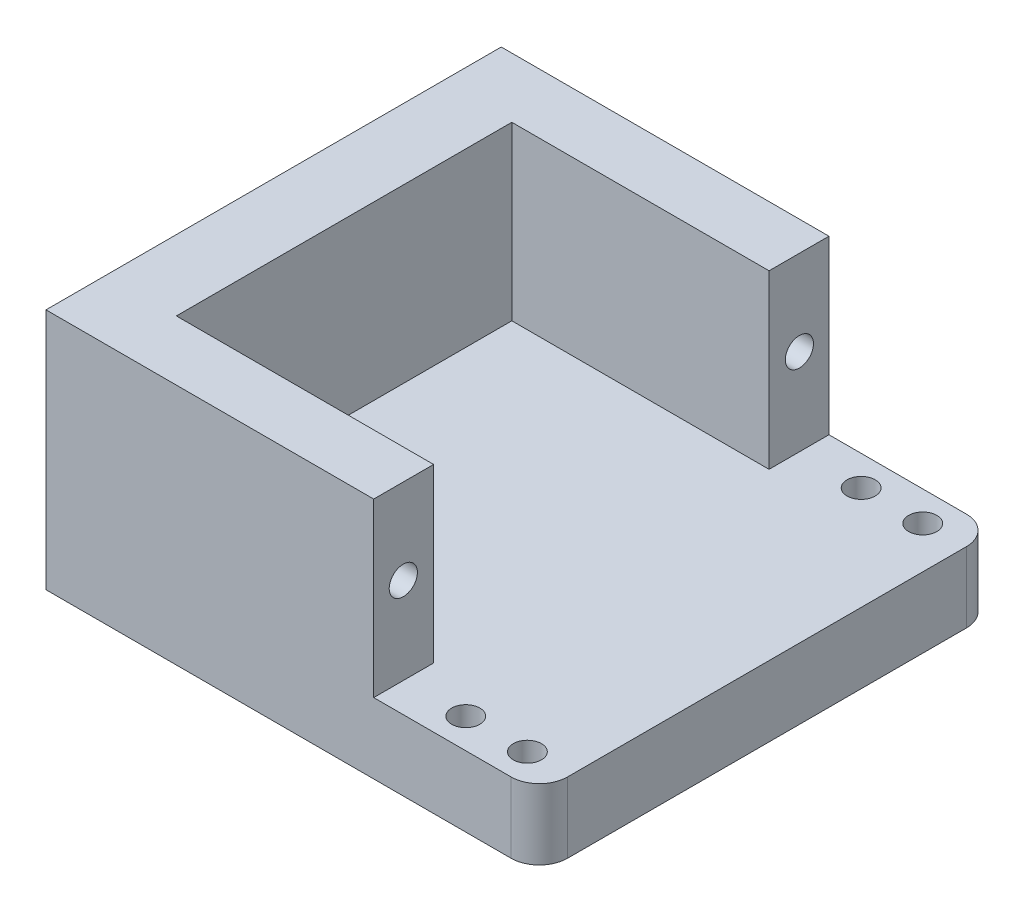
ISO-10303-21;
HEADER;
FILE_DESCRIPTION(('STEP AP214'),'2;1');
FILE_NAME('part.step','',(''),(''),'','','');
FILE_SCHEMA(('AUTOMOTIVE_DESIGN { 1 0 10303 214 1 1 1 1 }'));
ENDSEC;
DATA;
#1=APPLICATION_CONTEXT('core data for automotive mechanical design processes');
#2=APPLICATION_PROTOCOL_DEFINITION('international standard','automotive_design',2000,#1);
#3=PRODUCT_CONTEXT('',#1,'mechanical');
#4=PRODUCT('Part','Part','',(#3));
#5=PRODUCT_RELATED_PRODUCT_CATEGORY('part','',(#4));
#6=PRODUCT_DEFINITION_FORMATION('','',#4);
#7=PRODUCT_DEFINITION_CONTEXT('part definition',#1,'design');
#8=PRODUCT_DEFINITION('design','',#6,#7);
#9=PRODUCT_DEFINITION_SHAPE('','',#8);
#10=(LENGTH_UNIT() NAMED_UNIT(*) SI_UNIT(.MILLI.,.METRE.));
#11=(NAMED_UNIT(*) PLANE_ANGLE_UNIT() SI_UNIT($,.RADIAN.));
#12=(NAMED_UNIT(*) SI_UNIT($,.STERADIAN.) SOLID_ANGLE_UNIT());
#13=UNCERTAINTY_MEASURE_WITH_UNIT(LENGTH_MEASURE(1.E-05),#10,'distance_accuracy_value','');
#14=(GEOMETRIC_REPRESENTATION_CONTEXT(3) GLOBAL_UNCERTAINTY_ASSIGNED_CONTEXT((#13)) GLOBAL_UNIT_ASSIGNED_CONTEXT((#10,
#11,#12)) REPRESENTATION_CONTEXT('',''));
#15=CARTESIAN_POINT('',(0.,0.,0.));
#16=DIRECTION('',(0.,0.,1.));
#17=DIRECTION('',(1.,0.,0.));
#18=AXIS2_PLACEMENT_3D('',#15,#16,#17);
#19=CARTESIAN_POINT('',(0.,0.,0.));
#20=DIRECTION('',(0.,-1.,0.));
#21=DIRECTION('',(0.,0.,-1.));
#22=AXIS2_PLACEMENT_3D('',#19,#20,#21);
#23=PLANE('',#22);
#24=CARTESIAN_POINT('',(2.32234909325684,0.,-30.175));
#25=DIRECTION('',(0.,1.,0.));
#26=DIRECTION('',(0.,0.,1.));
#27=AXIS2_PLACEMENT_3D('',#24,#25,#26);
#28=CIRCLE('',#27,1.);
#29=CARTESIAN_POINT('',(2.32234909325684,0.,-29.175));
#30=VERTEX_POINT('',#29);
#31=EDGE_CURVE('E574',#30,#30,#28,.T.);
#32=ORIENTED_EDGE('',*,*,#31,.T.);
#33=EDGE_LOOP('',(#32));
#34=FACE_BOUND('',#33,.T.);
#35=CARTESIAN_POINT('',(32.0281080719325,0.,-30.175));
#36=DIRECTION('',(0.,1.,0.));
#37=DIRECTION('',(0.,0.,1.));
#38=AXIS2_PLACEMENT_3D('',#35,#36,#37);
#39=CIRCLE('',#38,0.999999999999998);
#40=CARTESIAN_POINT('',(32.0281080719325,0.,-29.175));
#41=VERTEX_POINT('',#40);
#42=EDGE_CURVE('E551',#41,#41,#39,.T.);
#43=ORIENTED_EDGE('',*,*,#42,.T.);
#44=EDGE_LOOP('',(#43));
#45=FACE_BOUND('',#44,.T.);
#46=CARTESIAN_POINT('',(32.0281080719325,0.,-2.125));
#47=DIRECTION('',(0.,1.,0.));
#48=DIRECTION('',(0.,0.,1.));
#49=AXIS2_PLACEMENT_3D('',#46,#47,#48);
#50=CIRCLE('',#49,0.999999999999998);
#51=CARTESIAN_POINT('',(32.0281080719325,0.,-1.125));
#52=VERTEX_POINT('',#51);
#53=EDGE_CURVE('E557',#52,#52,#50,.F.);
#54=ORIENTED_EDGE('',*,*,#53,.F.);
#55=EDGE_LOOP('',(#54));
#56=FACE_BOUND('',#55,.T.);
#57=CARTESIAN_POINT('',(27.6570821501849,0.,-30.175));
#58=DIRECTION('',(0.,1.,0.));
#59=DIRECTION('',(0.,0.,1.));
#60=AXIS2_PLACEMENT_3D('',#57,#58,#59);
#61=CIRCLE('',#60,1.);
#62=CARTESIAN_POINT('',(27.6570821501849,0.,-29.175));
#63=VERTEX_POINT('',#62);
#64=EDGE_CURVE('E543',#63,#63,#61,.T.);
#65=ORIENTED_EDGE('',*,*,#64,.T.);
#66=EDGE_LOOP('',(#65));
#67=FACE_BOUND('',#66,.T.);
#68=DIRECTION('',(-1.,0.,0.));
#69=VECTOR('',#68,1.);
#70=CARTESIAN_POINT('',(0.,0.,-32.3));
#71=LINE('',#70,#69);
#72=CARTESIAN_POINT('',(33.,0.,-32.3));
#73=VERTEX_POINT('',#72);
#74=CARTESIAN_POINT('',(0.,0.,-32.3));
#75=VERTEX_POINT('',#74);
#76=EDGE_CURVE('E200',#73,#75,#71,.T.);
#77=ORIENTED_EDGE('',*,*,#76,.F.);
#78=CARTESIAN_POINT('',(33.,0.,-30.3));
#79=DIRECTION('',(0.,-1.,0.));
#80=DIRECTION('',(0.,0.,-1.));
#81=AXIS2_PLACEMENT_3D('',#78,#79,#80);
#82=CIRCLE('',#81,2.);
#83=CARTESIAN_POINT('',(35.,0.,-30.3));
#84=VERTEX_POINT('',#83);
#85=EDGE_CURVE('E222',#73,#84,#82,.T.);
#86=ORIENTED_EDGE('',*,*,#85,.T.);
#87=DIRECTION('',(0.,0.,-1.));
#88=VECTOR('',#87,1.);
#89=CARTESIAN_POINT('',(35.,0.,0.));
#90=LINE('',#89,#88);
#91=CARTESIAN_POINT('',(35.,0.,-2.));
#92=VERTEX_POINT('',#91);
#93=EDGE_CURVE('E209',#92,#84,#90,.T.);
#94=ORIENTED_EDGE('',*,*,#93,.F.);
#95=CARTESIAN_POINT('',(33.,0.,-2.));
#96=DIRECTION('',(0.,-1.,0.));
#97=DIRECTION('',(0.,0.,-1.));
#98=AXIS2_PLACEMENT_3D('',#95,#96,#97);
#99=CIRCLE('',#98,2.);
#100=CARTESIAN_POINT('',(33.,0.,0.));
#101=VERTEX_POINT('',#100);
#102=EDGE_CURVE('E220',#92,#101,#99,.T.);
#103=ORIENTED_EDGE('',*,*,#102,.T.);
#104=DIRECTION('',(1.,0.,0.));
#105=VECTOR('',#104,1.);
#106=CARTESIAN_POINT('',(0.,0.,0.));
#107=LINE('',#106,#105);
#108=CARTESIAN_POINT('',(0.,0.,0.));
#109=VERTEX_POINT('',#108);
#110=EDGE_CURVE('E207',#109,#101,#107,.T.);
#111=ORIENTED_EDGE('',*,*,#110,.F.);
#112=DIRECTION('',(0.,0.,1.));
#113=VECTOR('',#112,1.);
#114=CARTESIAN_POINT('',(0.,0.,0.));
#115=LINE('',#114,#113);
#116=EDGE_CURVE('E194',#75,#109,#115,.T.);
#117=ORIENTED_EDGE('',*,*,#116,.F.);
#118=EDGE_LOOP('',(#77,#86,#94,#103,#111,#117));
#119=FACE_BOUND('',#118,.T.);
#120=CARTESIAN_POINT('',(27.6570821501849,0.,-2.125));
#121=DIRECTION('',(0.,1.,0.));
#122=DIRECTION('',(0.,0.,1.));
#123=AXIS2_PLACEMENT_3D('',#120,#121,#122);
#124=CIRCLE('',#123,1.);
#125=CARTESIAN_POINT('',(27.6570821501849,0.,-1.125));
#126=VERTEX_POINT('',#125);
#127=EDGE_CURVE('E556',#126,#126,#124,.F.);
#128=ORIENTED_EDGE('',*,*,#127,.F.);
#129=EDGE_LOOP('',(#128));
#130=FACE_BOUND('',#129,.T.);
#131=CARTESIAN_POINT('',(2.32234909325684,0.,-2.125));
#132=DIRECTION('',(0.,-1.,0.));
#133=DIRECTION('',(0.,0.,-1.));
#134=AXIS2_PLACEMENT_3D('',#131,#132,#133);
#135=CIRCLE('',#134,1.);
#136=CARTESIAN_POINT('',(2.32234909325684,0.,-3.125));
#137=VERTEX_POINT('',#136);
#138=EDGE_CURVE('E576',#137,#137,#135,.T.);
#139=ORIENTED_EDGE('',*,*,#138,.F.);
#140=EDGE_LOOP('',(#139));
#141=FACE_BOUND('',#140,.T.);
#142=ADVANCED_FACE('F43',(#34,#45,#56,#67,#119,#130,#141),#23,.T.);
#143=CARTESIAN_POINT('',(0.,5.,0.));
#144=DIRECTION('',(0.,-1.,0.));
#145=DIRECTION('',(0.,0.,-1.));
#146=AXIS2_PLACEMENT_3D('',#143,#144,#145);
#147=PLANE('',#146);
#148=CARTESIAN_POINT('',(32.0281080719325,5.,-30.175));
#149=DIRECTION('',(0.,1.,0.));
#150=DIRECTION('',(0.,0.,1.));
#151=AXIS2_PLACEMENT_3D('',#148,#149,#150);
#152=CIRCLE('',#151,0.999999999999998);
#153=CARTESIAN_POINT('',(32.0281080719325,5.,-29.175));
#154=VERTEX_POINT('',#153);
#155=EDGE_CURVE('E560',#154,#154,#152,.T.);
#156=ORIENTED_EDGE('',*,*,#155,.F.);
#157=EDGE_LOOP('',(#156));
#158=FACE_BOUND('',#157,.T.);
#159=CARTESIAN_POINT('',(27.6570821501849,5.,-30.175));
#160=DIRECTION('',(0.,1.,0.));
#161=DIRECTION('',(0.,0.,1.));
#162=AXIS2_PLACEMENT_3D('',#159,#160,#161);
#163=CIRCLE('',#162,1.);
#164=CARTESIAN_POINT('',(27.6570821501849,5.,-29.175));
#165=VERTEX_POINT('',#164);
#166=EDGE_CURVE('E546',#165,#165,#163,.T.);
#167=ORIENTED_EDGE('',*,*,#166,.F.);
#168=EDGE_LOOP('',(#167));
#169=FACE_BOUND('',#168,.T.);
#170=DIRECTION('',(0.,0.,-1.));
#171=VECTOR('',#170,1.);
#172=CARTESIAN_POINT('',(35.,5.,0.));
#173=LINE('',#172,#171);
#174=CARTESIAN_POINT('',(35.,5.,-2.));
#175=VERTEX_POINT('',#174);
#176=CARTESIAN_POINT('',(35.,5.,-30.3));
#177=VERTEX_POINT('',#176);
#178=EDGE_CURVE('E199',#175,#177,#173,.T.);
#179=ORIENTED_EDGE('',*,*,#178,.T.);
#180=CARTESIAN_POINT('',(33.,5.,-30.3));
#181=DIRECTION('',(0.,-1.,0.));
#182=DIRECTION('',(0.,0.,-1.));
#183=AXIS2_PLACEMENT_3D('',#180,#181,#182);
#184=CIRCLE('',#183,2.);
#185=CARTESIAN_POINT('',(33.,5.,-32.3));
#186=VERTEX_POINT('',#185);
#187=EDGE_CURVE('E51',#177,#186,#184,.F.);
#188=ORIENTED_EDGE('',*,*,#187,.T.);
#189=DIRECTION('',(-1.,0.,0.));
#190=VECTOR('',#189,1.);
#191=CARTESIAN_POINT('',(0.,5.,-32.3));
#192=LINE('',#191,#190);
#193=CARTESIAN_POINT('',(23.25,5.,-32.3));
#194=VERTEX_POINT('',#193);
#195=EDGE_CURVE('E202',#186,#194,#192,.T.);
#196=ORIENTED_EDGE('',*,*,#195,.T.);
#197=DIRECTION('',(0.,0.,1.));
#198=VECTOR('',#197,1.);
#199=CARTESIAN_POINT('',(23.25,5.,0.));
#200=LINE('',#199,#198);
#201=CARTESIAN_POINT('',(23.25,5.,-28.05));
#202=VERTEX_POINT('',#201);
#203=EDGE_CURVE('E156',#194,#202,#200,.T.);
#204=ORIENTED_EDGE('',*,*,#203,.T.);
#205=DIRECTION('',(-1.,0.,0.));
#206=VECTOR('',#205,1.);
#207=CARTESIAN_POINT('',(0.,5.,-28.05));
#208=LINE('',#207,#206);
#209=CARTESIAN_POINT('',(4.99999999999999,5.,-28.05));
#210=VERTEX_POINT('',#209);
#211=EDGE_CURVE('E139',#202,#210,#208,.T.);
#212=ORIENTED_EDGE('',*,*,#211,.T.);
#213=DIRECTION('',(0.,0.,-1.));
#214=VECTOR('',#213,1.);
#215=CARTESIAN_POINT('',(4.99999999999999,5.,-32.3));
#216=LINE('',#215,#214);
#217=CARTESIAN_POINT('',(5.,5.,-4.25));
#218=VERTEX_POINT('',#217);
#219=EDGE_CURVE('E185',#218,#210,#216,.T.);
#220=ORIENTED_EDGE('',*,*,#219,.F.);
#221=DIRECTION('',(-1.,0.,0.));
#222=VECTOR('',#221,1.);
#223=CARTESIAN_POINT('',(0.,5.,-4.25));
#224=LINE('',#223,#222);
#225=CARTESIAN_POINT('',(23.25,5.,-4.25));
#226=VERTEX_POINT('',#225);
#227=EDGE_CURVE('E173',#226,#218,#224,.T.);
#228=ORIENTED_EDGE('',*,*,#227,.F.);
#229=DIRECTION('',(0.,0.,-1.));
#230=VECTOR('',#229,1.);
#231=CARTESIAN_POINT('',(23.25,5.,0.));
#232=LINE('',#231,#230);
#233=CARTESIAN_POINT('',(23.25,5.,0.));
#234=VERTEX_POINT('',#233);
#235=EDGE_CURVE('E144',#234,#226,#232,.T.);
#236=ORIENTED_EDGE('',*,*,#235,.F.);
#237=DIRECTION('',(1.,0.,0.));
#238=VECTOR('',#237,1.);
#239=CARTESIAN_POINT('',(0.,5.,0.));
#240=LINE('',#239,#238);
#241=CARTESIAN_POINT('',(33.,5.,0.));
#242=VERTEX_POINT('',#241);
#243=EDGE_CURVE('E197',#234,#242,#240,.T.);
#244=ORIENTED_EDGE('',*,*,#243,.T.);
#245=CARTESIAN_POINT('',(33.,5.,-2.));
#246=DIRECTION('',(0.,-1.,0.));
#247=DIRECTION('',(0.,0.,-1.));
#248=AXIS2_PLACEMENT_3D('',#245,#246,#247);
#249=CIRCLE('',#248,2.);
#250=EDGE_CURVE('E228',#242,#175,#249,.F.);
#251=ORIENTED_EDGE('',*,*,#250,.T.);
#252=EDGE_LOOP('',(#179,#188,#196,#204,#212,#220,#228,#236,#244,#251));
#253=FACE_BOUND('',#252,.T.);
#254=CARTESIAN_POINT('',(32.0281080719325,5.,-2.125));
#255=DIRECTION('',(0.,1.,0.));
#256=DIRECTION('',(0.,0.,1.));
#257=AXIS2_PLACEMENT_3D('',#254,#255,#256);
#258=CIRCLE('',#257,0.999999999999998);
#259=CARTESIAN_POINT('',(32.0281080719325,5.,-1.125));
#260=VERTEX_POINT('',#259);
#261=EDGE_CURVE('E565',#260,#260,#258,.F.);
#262=ORIENTED_EDGE('',*,*,#261,.T.);
#263=EDGE_LOOP('',(#262));
#264=FACE_BOUND('',#263,.T.);
#265=CARTESIAN_POINT('',(27.6570821501849,5.,-2.125));
#266=DIRECTION('',(0.,1.,0.));
#267=DIRECTION('',(0.,0.,1.));
#268=AXIS2_PLACEMENT_3D('',#265,#266,#267);
#269=CIRCLE('',#268,1.);
#270=CARTESIAN_POINT('',(27.6570821501849,5.,-1.125));
#271=VERTEX_POINT('',#270);
#272=EDGE_CURVE('E553',#271,#271,#269,.F.);
#273=ORIENTED_EDGE('',*,*,#272,.T.);
#274=EDGE_LOOP('',(#273));
#275=FACE_BOUND('',#274,.T.);
#276=ADVANCED_FACE('F232',(#158,#169,#253,#264,#275),#147,.F.);
#277=CARTESIAN_POINT('',(4.99999999999999,17.2,-32.3));
#278=DIRECTION('',(-1.,0.,0.));
#279=DIRECTION('',(0.,0.,1.));
#280=AXIS2_PLACEMENT_3D('',#277,#278,#279);
#281=PLANE('',#280);
#282=ORIENTED_EDGE('',*,*,#219,.T.);
#283=DIRECTION('',(0.,-1.,0.));
#284=VECTOR('',#283,1.);
#285=CARTESIAN_POINT('',(4.99999999999999,17.2,-28.05));
#286=LINE('',#285,#284);
#287=CARTESIAN_POINT('',(4.99999999999999,17.2,-28.05));
#288=VERTEX_POINT('',#287);
#289=EDGE_CURVE('E161',#288,#210,#286,.T.);
#290=ORIENTED_EDGE('',*,*,#289,.F.);
#291=DIRECTION('',(0.,0.,-1.));
#292=VECTOR('',#291,1.);
#293=CARTESIAN_POINT('',(4.99999999999999,17.2,-32.3));
#294=LINE('',#293,#292);
#295=CARTESIAN_POINT('',(5.,17.2,-4.25));
#296=VERTEX_POINT('',#295);
#297=EDGE_CURVE('E155',#296,#288,#294,.T.);
#298=ORIENTED_EDGE('',*,*,#297,.F.);
#299=DIRECTION('',(0.,-1.,0.));
#300=VECTOR('',#299,1.);
#301=CARTESIAN_POINT('',(5.,17.2,-4.25));
#302=LINE('',#301,#300);
#303=EDGE_CURVE('E175',#296,#218,#302,.T.);
#304=ORIENTED_EDGE('',*,*,#303,.T.);
#305=EDGE_LOOP('',(#282,#290,#298,#304));
#306=FACE_BOUND('',#305,.T.);
#307=ADVANCED_FACE('F265',(#306),#281,.F.);
#308=CARTESIAN_POINT('',(0.,5.,0.));
#309=DIRECTION('',(1.,0.,0.));
#310=DIRECTION('',(0.,0.,-1.));
#311=AXIS2_PLACEMENT_3D('',#308,#309,#310);
#312=PLANE('',#311);
#313=ORIENTED_EDGE('',*,*,#116,.T.);
#314=DIRECTION('',(0.,-1.,0.));
#315=VECTOR('',#314,1.);
#316=CARTESIAN_POINT('',(0.,5.,0.));
#317=LINE('',#316,#315);
#318=CARTESIAN_POINT('',(0.,17.2,0.));
#319=VERTEX_POINT('',#318);
#320=EDGE_CURVE('E214',#319,#109,#317,.T.);
#321=ORIENTED_EDGE('',*,*,#320,.F.);
#322=DIRECTION('',(0.,0.,1.));
#323=VECTOR('',#322,1.);
#324=CARTESIAN_POINT('',(0.,17.2,0.));
#325=LINE('',#324,#323);
#326=CARTESIAN_POINT('',(0.,17.2,-32.3));
#327=VERTEX_POINT('',#326);
#328=EDGE_CURVE('E188',#327,#319,#325,.T.);
#329=ORIENTED_EDGE('',*,*,#328,.F.);
#330=DIRECTION('',(0.,-1.,0.));
#331=VECTOR('',#330,1.);
#332=CARTESIAN_POINT('',(0.,5.,-32.3));
#333=LINE('',#332,#331);
#334=EDGE_CURVE('E204',#327,#75,#333,.T.);
#335=ORIENTED_EDGE('',*,*,#334,.T.);
#336=EDGE_LOOP('',(#313,#321,#329,#335));
#337=FACE_BOUND('',#336,.T.);
#338=ADVANCED_FACE('F253',(#337),#312,.F.);
#339=CARTESIAN_POINT('',(0.,5.,0.));
#340=DIRECTION('',(0.,0.,-1.));
#341=DIRECTION('',(-1.,0.,0.));
#342=AXIS2_PLACEMENT_3D('',#339,#340,#341);
#343=PLANE('',#342);
#344=ORIENTED_EDGE('',*,*,#110,.T.);
#345=DIRECTION('',(0.,-1.,0.));
#346=VECTOR('',#345,1.);
#347=CARTESIAN_POINT('',(33.,5.,0.));
#348=LINE('',#347,#346);
#349=EDGE_CURVE('E11',#101,#242,#348,.F.);
#350=ORIENTED_EDGE('',*,*,#349,.T.);
#351=ORIENTED_EDGE('',*,*,#243,.F.);
#352=DIRECTION('',(0.,-1.,0.));
#353=VECTOR('',#352,1.);
#354=CARTESIAN_POINT('',(23.25,17.2,0.));
#355=LINE('',#354,#353);
#356=CARTESIAN_POINT('',(23.25,17.2,0.));
#357=VERTEX_POINT('',#356);
#358=EDGE_CURVE('E183',#357,#234,#355,.T.);
#359=ORIENTED_EDGE('',*,*,#358,.F.);
#360=DIRECTION('',(1.,0.,0.));
#361=VECTOR('',#360,1.);
#362=CARTESIAN_POINT('',(5.,17.2,0.));
#363=LINE('',#362,#361);
#364=EDGE_CURVE('E191',#319,#357,#363,.T.);
#365=ORIENTED_EDGE('',*,*,#364,.F.);
#366=ORIENTED_EDGE('',*,*,#320,.T.);
#367=EDGE_LOOP('',(#344,#350,#351,#359,#365,#366));
#368=FACE_BOUND('',#367,.T.);
#369=ADVANCED_FACE('F248',(#368),#343,.F.);
#370=CARTESIAN_POINT('',(35.,5.,0.));
#371=DIRECTION('',(-1.,0.,0.));
#372=DIRECTION('',(0.,0.,1.));
#373=AXIS2_PLACEMENT_3D('',#370,#371,#372);
#374=PLANE('',#373);
#375=ORIENTED_EDGE('',*,*,#93,.T.);
#376=DIRECTION('',(0.,-1.,0.));
#377=VECTOR('',#376,1.);
#378=CARTESIAN_POINT('',(35.,5.,-30.3));
#379=LINE('',#378,#377);
#380=EDGE_CURVE('E64',#84,#177,#379,.F.);
#381=ORIENTED_EDGE('',*,*,#380,.T.);
#382=ORIENTED_EDGE('',*,*,#178,.F.);
#383=DIRECTION('',(0.,-1.,0.));
#384=VECTOR('',#383,1.);
#385=CARTESIAN_POINT('',(35.,5.,-2.));
#386=LINE('',#385,#384);
#387=EDGE_CURVE('E224',#175,#92,#386,.T.);
#388=ORIENTED_EDGE('',*,*,#387,.T.);
#389=EDGE_LOOP('',(#375,#381,#382,#388));
#390=FACE_BOUND('',#389,.T.);
#391=ADVANCED_FACE('F244',(#390),#374,.F.);
#392=CARTESIAN_POINT('',(0.,5.,-32.3));
#393=DIRECTION('',(0.,0.,1.));
#394=DIRECTION('',(1.,0.,0.));
#395=AXIS2_PLACEMENT_3D('',#392,#393,#394);
#396=PLANE('',#395);
#397=ORIENTED_EDGE('',*,*,#195,.F.);
#398=DIRECTION('',(0.,-1.,0.));
#399=VECTOR('',#398,1.);
#400=CARTESIAN_POINT('',(33.,5.,-32.3));
#401=LINE('',#400,#399);
#402=EDGE_CURVE('E217',#186,#73,#401,.T.);
#403=ORIENTED_EDGE('',*,*,#402,.T.);
#404=ORIENTED_EDGE('',*,*,#76,.T.);
#405=ORIENTED_EDGE('',*,*,#334,.F.);
#406=DIRECTION('',(-1.,0.,0.));
#407=VECTOR('',#406,1.);
#408=CARTESIAN_POINT('',(0.,17.2,-32.3));
#409=LINE('',#408,#407);
#410=CARTESIAN_POINT('',(23.25,17.2,-32.3));
#411=VERTEX_POINT('',#410);
#412=EDGE_CURVE('E186',#411,#327,#409,.T.);
#413=ORIENTED_EDGE('',*,*,#412,.F.);
#414=DIRECTION('',(0.,-1.,0.));
#415=VECTOR('',#414,1.);
#416=CARTESIAN_POINT('',(23.25,17.2,-32.3));
#417=LINE('',#416,#415);
#418=EDGE_CURVE('E145',#411,#194,#417,.T.);
#419=ORIENTED_EDGE('',*,*,#418,.T.);
#420=EDGE_LOOP('',(#397,#403,#404,#405,#413,#419));
#421=FACE_BOUND('',#420,.T.);
#422=ADVANCED_FACE('F237',(#421),#396,.F.);
#423=CARTESIAN_POINT('',(0.,17.2,0.));
#424=DIRECTION('',(0.,-1.,0.));
#425=DIRECTION('',(0.,0.,-1.));
#426=AXIS2_PLACEMENT_3D('',#423,#424,#425);
#427=PLANE('',#426);
#428=ORIENTED_EDGE('',*,*,#412,.T.);
#429=ORIENTED_EDGE('',*,*,#328,.T.);
#430=ORIENTED_EDGE('',*,*,#364,.T.);
#431=DIRECTION('',(0.,0.,-1.));
#432=VECTOR('',#431,1.);
#433=CARTESIAN_POINT('',(23.25,17.2,0.));
#434=LINE('',#433,#432);
#435=CARTESIAN_POINT('',(23.25,17.2,-4.25));
#436=VERTEX_POINT('',#435);
#437=EDGE_CURVE('E170',#357,#436,#434,.T.);
#438=ORIENTED_EDGE('',*,*,#437,.T.);
#439=DIRECTION('',(-1.,0.,0.));
#440=VECTOR('',#439,1.);
#441=CARTESIAN_POINT('',(0.,17.2,-4.25));
#442=LINE('',#441,#440);
#443=EDGE_CURVE('E172',#436,#296,#442,.T.);
#444=ORIENTED_EDGE('',*,*,#443,.T.);
#445=ORIENTED_EDGE('',*,*,#297,.T.);
#446=DIRECTION('',(-1.,0.,0.));
#447=VECTOR('',#446,1.);
#448=CARTESIAN_POINT('',(0.,17.2,-28.05));
#449=LINE('',#448,#447);
#450=CARTESIAN_POINT('',(23.25,17.2,-28.05));
#451=VERTEX_POINT('',#450);
#452=EDGE_CURVE('E136',#451,#288,#449,.T.);
#453=ORIENTED_EDGE('',*,*,#452,.F.);
#454=DIRECTION('',(0.,0.,1.));
#455=VECTOR('',#454,1.);
#456=CARTESIAN_POINT('',(23.25,17.2,0.));
#457=LINE('',#456,#455);
#458=EDGE_CURVE('E152',#411,#451,#457,.T.);
#459=ORIENTED_EDGE('',*,*,#458,.F.);
#460=EDGE_LOOP('',(#428,#429,#430,#438,#444,#445,#453,#459));
#461=FACE_BOUND('',#460,.T.);
#462=ADVANCED_FACE('F151',(#461),#427,.F.);
#463=CARTESIAN_POINT('',(23.25,17.2,0.));
#464=DIRECTION('',(-1.,0.,0.));
#465=DIRECTION('',(0.,0.,1.));
#466=AXIS2_PLACEMENT_3D('',#463,#464,#465);
#467=PLANE('',#466);
#468=CARTESIAN_POINT('',(23.25,11.15,-2.1));
#469=DIRECTION('',(1.,0.,0.));
#470=DIRECTION('',(0.,0.,-1.));
#471=AXIS2_PLACEMENT_3D('',#468,#469,#470);
#472=CIRCLE('',#471,1.);
#473=CARTESIAN_POINT('',(23.25,11.15,-3.1));
#474=VERTEX_POINT('',#473);
#475=EDGE_CURVE('E532',#474,#474,#472,.T.);
#476=ORIENTED_EDGE('',*,*,#475,.F.);
#477=EDGE_LOOP('',(#476));
#478=FACE_BOUND('',#477,.T.);
#479=ORIENTED_EDGE('',*,*,#235,.T.);
#480=DIRECTION('',(0.,-1.,0.));
#481=VECTOR('',#480,1.);
#482=CARTESIAN_POINT('',(23.25,17.2,-4.25));
#483=LINE('',#482,#481);
#484=EDGE_CURVE('E180',#436,#226,#483,.T.);
#485=ORIENTED_EDGE('',*,*,#484,.F.);
#486=ORIENTED_EDGE('',*,*,#437,.F.);
#487=ORIENTED_EDGE('',*,*,#358,.T.);
#488=EDGE_LOOP('',(#479,#485,#486,#487));
#489=FACE_BOUND('',#488,.T.);
#490=ADVANCED_FACE('F257',(#478,#489),#467,.F.);
#491=CARTESIAN_POINT('',(0.,17.2,-4.25));
#492=DIRECTION('',(0.,0.,1.));
#493=DIRECTION('',(1.,0.,0.));
#494=AXIS2_PLACEMENT_3D('',#491,#492,#493);
#495=PLANE('',#494);
#496=ORIENTED_EDGE('',*,*,#227,.T.);
#497=ORIENTED_EDGE('',*,*,#303,.F.);
#498=ORIENTED_EDGE('',*,*,#443,.F.);
#499=ORIENTED_EDGE('',*,*,#484,.T.);
#500=EDGE_LOOP('',(#496,#497,#498,#499));
#501=FACE_BOUND('',#500,.T.);
#502=ADVANCED_FACE('F263',(#501),#495,.F.);
#503=CARTESIAN_POINT('',(0.,17.2,-28.05));
#504=DIRECTION('',(0.,0.,1.));
#505=DIRECTION('',(1.,0.,0.));
#506=AXIS2_PLACEMENT_3D('',#503,#504,#505);
#507=PLANE('',#506);
#508=ORIENTED_EDGE('',*,*,#211,.F.);
#509=DIRECTION('',(0.,-1.,0.));
#510=VECTOR('',#509,1.);
#511=CARTESIAN_POINT('',(23.25,17.2,-28.05));
#512=LINE('',#511,#510);
#513=EDGE_CURVE('E133',#451,#202,#512,.T.);
#514=ORIENTED_EDGE('',*,*,#513,.F.);
#515=ORIENTED_EDGE('',*,*,#452,.T.);
#516=ORIENTED_EDGE('',*,*,#289,.T.);
#517=EDGE_LOOP('',(#508,#514,#515,#516));
#518=FACE_BOUND('',#517,.T.);
#519=ADVANCED_FACE('F135',(#518),#507,.T.);
#520=CARTESIAN_POINT('',(23.25,17.2,0.));
#521=DIRECTION('',(1.,0.,0.));
#522=DIRECTION('',(0.,0.,-1.));
#523=AXIS2_PLACEMENT_3D('',#520,#521,#522);
#524=PLANE('',#523);
#525=CARTESIAN_POINT('',(23.25,11.15,-30.2));
#526=DIRECTION('',(1.,0.,0.));
#527=DIRECTION('',(0.,0.,-1.));
#528=AXIS2_PLACEMENT_3D('',#525,#526,#527);
#529=CIRCLE('',#528,1.);
#530=CARTESIAN_POINT('',(23.25,11.15,-31.2));
#531=VERTEX_POINT('',#530);
#532=EDGE_CURVE('E539',#531,#531,#529,.F.);
#533=ORIENTED_EDGE('',*,*,#532,.T.);
#534=EDGE_LOOP('',(#533));
#535=FACE_BOUND('',#534,.T.);
#536=ORIENTED_EDGE('',*,*,#203,.F.);
#537=ORIENTED_EDGE('',*,*,#418,.F.);
#538=ORIENTED_EDGE('',*,*,#458,.T.);
#539=ORIENTED_EDGE('',*,*,#513,.T.);
#540=EDGE_LOOP('',(#536,#537,#538,#539));
#541=FACE_BOUND('',#540,.T.);
#542=ADVANCED_FACE('F159',(#535,#541),#524,.T.);
#543=CARTESIAN_POINT('',(18.25,11.15,-30.2));
#544=DIRECTION('',(1.,0.,0.));
#545=DIRECTION('',(0.,0.,-1.));
#546=AXIS2_PLACEMENT_3D('',#543,#544,#545);
#547=CYLINDRICAL_SURFACE('',#546,1.);
#548=CARTESIAN_POINT('',(18.25,11.15,-30.2));
#549=DIRECTION('',(1.,0.,0.));
#550=DIRECTION('',(0.,0.,-1.));
#551=AXIS2_PLACEMENT_3D('',#548,#549,#550);
#552=CIRCLE('',#551,1.);
#553=CARTESIAN_POINT('',(18.25,11.15,-31.2));
#554=VERTEX_POINT('',#553);
#555=EDGE_CURVE('E534',#554,#554,#552,.F.);
#556=ORIENTED_EDGE('',*,*,#555,.T.);
#557=EDGE_LOOP('',(#556));
#558=FACE_BOUND('',#557,.T.);
#559=ORIENTED_EDGE('',*,*,#532,.F.);
#560=EDGE_LOOP('',(#559));
#561=FACE_BOUND('',#560,.T.);
#562=ADVANCED_FACE('F341',(#558,#561),#547,.F.);
#563=CARTESIAN_POINT('',(18.25,0.,0.));
#564=DIRECTION('',(1.,0.,0.));
#565=DIRECTION('',(0.,0.,-1.));
#566=AXIS2_PLACEMENT_3D('',#563,#564,#565);
#567=PLANE('',#566);
#568=ORIENTED_EDGE('',*,*,#555,.F.);
#569=EDGE_LOOP('',(#568));
#570=FACE_BOUND('',#569,.T.);
#571=ADVANCED_FACE('F337',(#570),#567,.T.);
#572=CARTESIAN_POINT('',(18.25,11.15,-2.1));
#573=DIRECTION('',(1.,0.,0.));
#574=DIRECTION('',(0.,0.,-1.));
#575=AXIS2_PLACEMENT_3D('',#572,#573,#574);
#576=CYLINDRICAL_SURFACE('',#575,1.);
#577=CARTESIAN_POINT('',(18.25,11.15,-2.1));
#578=DIRECTION('',(1.,0.,0.));
#579=DIRECTION('',(0.,0.,-1.));
#580=AXIS2_PLACEMENT_3D('',#577,#578,#579);
#581=CIRCLE('',#580,1.);
#582=CARTESIAN_POINT('',(18.25,11.15,-3.1));
#583=VERTEX_POINT('',#582);
#584=EDGE_CURVE('E167',#583,#583,#581,.T.);
#585=ORIENTED_EDGE('',*,*,#584,.F.);
#586=EDGE_LOOP('',(#585));
#587=FACE_BOUND('',#586,.T.);
#588=ORIENTED_EDGE('',*,*,#475,.T.);
#589=EDGE_LOOP('',(#588));
#590=FACE_BOUND('',#589,.T.);
#591=ADVANCED_FACE('F333',(#587,#590),#576,.F.);
#592=CARTESIAN_POINT('',(18.25,0.,0.));
#593=DIRECTION('',(1.,0.,0.));
#594=DIRECTION('',(0.,0.,-1.));
#595=AXIS2_PLACEMENT_3D('',#592,#593,#594);
#596=PLANE('',#595);
#597=ORIENTED_EDGE('',*,*,#584,.T.);
#598=EDGE_LOOP('',(#597));
#599=FACE_BOUND('',#598,.T.);
#600=ADVANCED_FACE('F329',(#599),#596,.T.);
#601=CARTESIAN_POINT('',(27.6570821501849,0.,-30.175));
#602=DIRECTION('',(0.,1.,0.));
#603=DIRECTION('',(0.,0.,1.));
#604=AXIS2_PLACEMENT_3D('',#601,#602,#603);
#605=CYLINDRICAL_SURFACE('',#604,1.);
#606=ORIENTED_EDGE('',*,*,#64,.F.);
#607=EDGE_LOOP('',(#606));
#608=FACE_BOUND('',#607,.T.);
#609=ORIENTED_EDGE('',*,*,#166,.T.);
#610=EDGE_LOOP('',(#609));
#611=FACE_BOUND('',#610,.T.);
#612=ADVANCED_FACE('F319',(#608,#611),#605,.F.);
#613=CARTESIAN_POINT('',(32.0281080719325,0.,-2.125));
#614=DIRECTION('',(0.,1.,0.));
#615=DIRECTION('',(0.,0.,1.));
#616=AXIS2_PLACEMENT_3D('',#613,#614,#615);
#617=CYLINDRICAL_SURFACE('',#616,0.999999999999998);
#618=ORIENTED_EDGE('',*,*,#53,.T.);
#619=EDGE_LOOP('',(#618));
#620=FACE_BOUND('',#619,.T.);
#621=ORIENTED_EDGE('',*,*,#261,.F.);
#622=EDGE_LOOP('',(#621));
#623=FACE_BOUND('',#622,.T.);
#624=ADVANCED_FACE('F315',(#620,#623),#617,.F.);
#625=CARTESIAN_POINT('',(27.6570821501849,0.,-2.125));
#626=DIRECTION('',(0.,1.,0.));
#627=DIRECTION('',(0.,0.,1.));
#628=AXIS2_PLACEMENT_3D('',#625,#626,#627);
#629=CYLINDRICAL_SURFACE('',#628,1.);
#630=ORIENTED_EDGE('',*,*,#127,.T.);
#631=EDGE_LOOP('',(#630));
#632=FACE_BOUND('',#631,.T.);
#633=ORIENTED_EDGE('',*,*,#272,.F.);
#634=EDGE_LOOP('',(#633));
#635=FACE_BOUND('',#634,.T.);
#636=ADVANCED_FACE('F318',(#632,#635),#629,.F.);
#637=CARTESIAN_POINT('',(32.0281080719325,0.,-30.175));
#638=DIRECTION('',(0.,1.,0.));
#639=DIRECTION('',(0.,0.,1.));
#640=AXIS2_PLACEMENT_3D('',#637,#638,#639);
#641=CYLINDRICAL_SURFACE('',#640,0.999999999999998);
#642=ORIENTED_EDGE('',*,*,#42,.F.);
#643=EDGE_LOOP('',(#642));
#644=FACE_BOUND('',#643,.T.);
#645=ORIENTED_EDGE('',*,*,#155,.T.);
#646=EDGE_LOOP('',(#645));
#647=FACE_BOUND('',#646,.T.);
#648=ADVANCED_FACE('F310',(#644,#647),#641,.F.);
#649=CARTESIAN_POINT('',(2.32234909325684,5.,-30.175));
#650=DIRECTION('',(0.,-1.,0.));
#651=DIRECTION('',(0.,0.,-1.));
#652=AXIS2_PLACEMENT_3D('',#649,#650,#651);
#653=CYLINDRICAL_SURFACE('',#652,1.);
#654=CARTESIAN_POINT('',(2.32234909325684,5.,-30.175));
#655=DIRECTION('',(0.,1.,0.));
#656=DIRECTION('',(0.,0.,1.));
#657=AXIS2_PLACEMENT_3D('',#654,#655,#656);
#658=CIRCLE('',#657,1.);
#659=CARTESIAN_POINT('',(2.32234909325684,5.,-29.175));
#660=VERTEX_POINT('',#659);
#661=EDGE_CURVE('E571',#660,#660,#658,.T.);
#662=ORIENTED_EDGE('',*,*,#661,.T.);
#663=EDGE_LOOP('',(#662));
#664=FACE_BOUND('',#663,.T.);
#665=ORIENTED_EDGE('',*,*,#31,.F.);
#666=EDGE_LOOP('',(#665));
#667=FACE_BOUND('',#666,.T.);
#668=ADVANCED_FACE('F307',(#664,#667),#653,.F.);
#669=CARTESIAN_POINT('',(2.32234909325684,5.,-30.175));
#670=DIRECTION('',(0.,1.,0.));
#671=DIRECTION('',(0.,0.,1.));
#672=AXIS2_PLACEMENT_3D('',#669,#670,#671);
#673=PLANE('',#672);
#674=ORIENTED_EDGE('',*,*,#661,.F.);
#675=EDGE_LOOP('',(#674));
#676=FACE_BOUND('',#675,.T.);
#677=ADVANCED_FACE('F302',(#676),#673,.F.);
#678=CARTESIAN_POINT('',(2.32234909325684,5.,-2.125));
#679=DIRECTION('',(0.,-1.,0.));
#680=DIRECTION('',(0.,0.,-1.));
#681=AXIS2_PLACEMENT_3D('',#678,#679,#680);
#682=CYLINDRICAL_SURFACE('',#681,1.);
#683=CARTESIAN_POINT('',(2.32234909325684,5.,-2.125));
#684=DIRECTION('',(0.,-1.,0.));
#685=DIRECTION('',(0.,0.,-1.));
#686=AXIS2_PLACEMENT_3D('',#683,#684,#685);
#687=CIRCLE('',#686,1.);
#688=CARTESIAN_POINT('',(2.32234909325684,5.,-3.125));
#689=VERTEX_POINT('',#688);
#690=EDGE_CURVE('E568',#689,#689,#687,.T.);
#691=ORIENTED_EDGE('',*,*,#690,.F.);
#692=EDGE_LOOP('',(#691));
#693=FACE_BOUND('',#692,.T.);
#694=ORIENTED_EDGE('',*,*,#138,.T.);
#695=EDGE_LOOP('',(#694));
#696=FACE_BOUND('',#695,.T.);
#697=ADVANCED_FACE('F296',(#693,#696),#682,.F.);
#698=CARTESIAN_POINT('',(0.,5.,0.));
#699=DIRECTION('',(0.,-1.,0.));
#700=DIRECTION('',(0.,0.,-1.));
#701=AXIS2_PLACEMENT_3D('',#698,#699,#700);
#702=PLANE('',#701);
#703=ORIENTED_EDGE('',*,*,#690,.T.);
#704=EDGE_LOOP('',(#703));
#705=FACE_BOUND('',#704,.T.);
#706=ADVANCED_FACE('F292',(#705),#702,.T.);
#707=CARTESIAN_POINT('',(33.,5.,-30.3));
#708=DIRECTION('',(0.,-1.,0.));
#709=DIRECTION('',(0.,0.,-1.));
#710=AXIS2_PLACEMENT_3D('',#707,#708,#709);
#711=CYLINDRICAL_SURFACE('',#710,2.);
#712=ORIENTED_EDGE('',*,*,#187,.F.);
#713=ORIENTED_EDGE('',*,*,#380,.F.);
#714=ORIENTED_EDGE('',*,*,#85,.F.);
#715=ORIENTED_EDGE('',*,*,#402,.F.);
#716=EDGE_LOOP('',(#712,#713,#714,#715));
#717=FACE_BOUND('',#716,.T.);
#718=ADVANCED_FACE('F239',(#717),#711,.T.);
#719=CARTESIAN_POINT('',(33.,5.,-2.));
#720=DIRECTION('',(0.,-1.,0.));
#721=DIRECTION('',(0.,0.,-1.));
#722=AXIS2_PLACEMENT_3D('',#719,#720,#721);
#723=CYLINDRICAL_SURFACE('',#722,2.);
#724=ORIENTED_EDGE('',*,*,#250,.F.);
#725=ORIENTED_EDGE('',*,*,#349,.F.);
#726=ORIENTED_EDGE('',*,*,#102,.F.);
#727=ORIENTED_EDGE('',*,*,#387,.F.);
#728=EDGE_LOOP('',(#724,#725,#726,#727));
#729=FACE_BOUND('',#728,.T.);
#730=ADVANCED_FACE('F45',(#729),#723,.T.);
#731=CLOSED_SHELL('',(#142,#276,#307,#338,#369,#391,#422,#462,#490,#502,#519,#542,#562,#571,
#591,#600,#612,#624,#636,#648,#668,#677,#697,#706,#718,#730));
#732=MANIFOLD_SOLID_BREP('B2',#731);
#733=ADVANCED_BREP_SHAPE_REPRESENTATION('',(#18,#732),#14);
#734=SHAPE_DEFINITION_REPRESENTATION(#9,#733);
ENDSEC;
END-ISO-10303-21;
